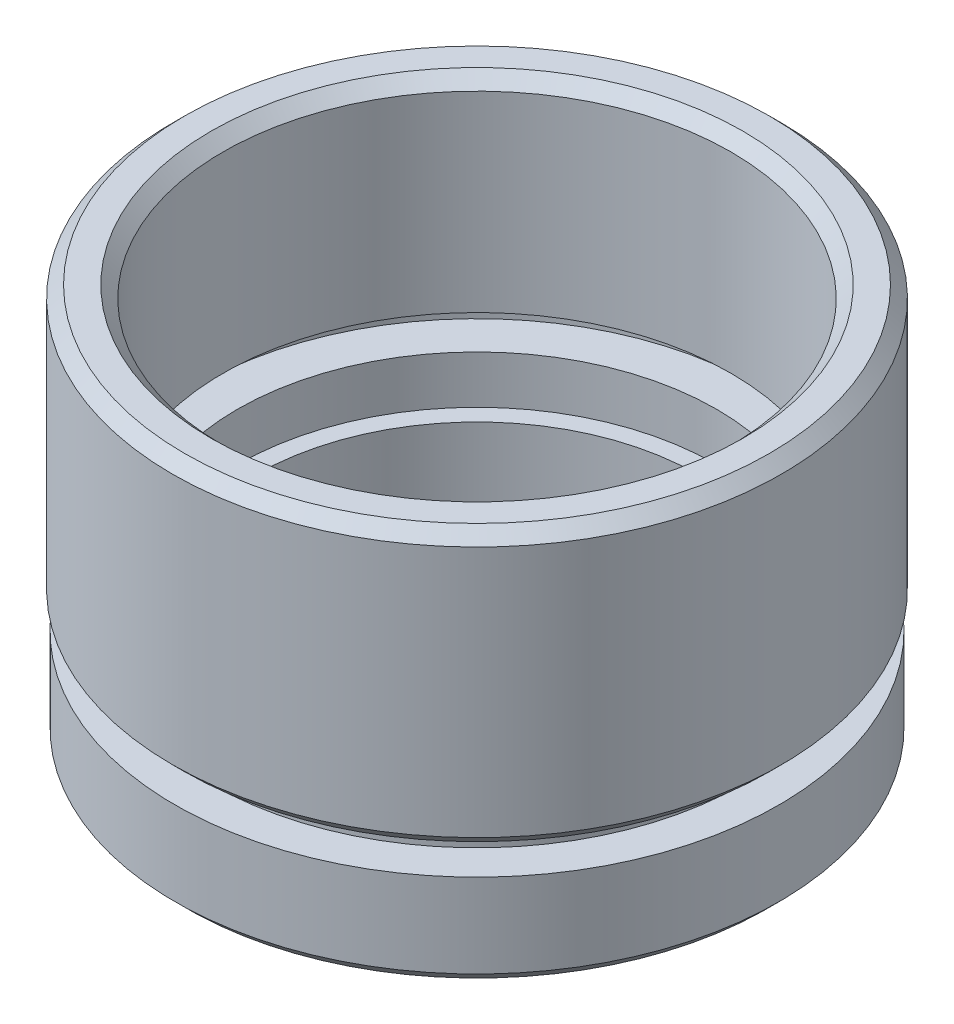
ISO-10303-21;
HEADER;
FILE_DESCRIPTION(('STEP AP214'),'2;1');
FILE_NAME('part.step','',(''),(''),'','','');
FILE_SCHEMA(('AUTOMOTIVE_DESIGN { 1 0 10303 214 1 1 1 1 }'));
ENDSEC;
DATA;
#1=APPLICATION_CONTEXT('core data for automotive mechanical design processes');
#2=APPLICATION_PROTOCOL_DEFINITION('international standard','automotive_design',2000,#1);
#3=PRODUCT_CONTEXT('',#1,'mechanical');
#4=PRODUCT('Part','Part','',(#3));
#5=PRODUCT_RELATED_PRODUCT_CATEGORY('part','',(#4));
#6=PRODUCT_DEFINITION_FORMATION('','',#4);
#7=PRODUCT_DEFINITION_CONTEXT('part definition',#1,'design');
#8=PRODUCT_DEFINITION('design','',#6,#7);
#9=PRODUCT_DEFINITION_SHAPE('','',#8);
#10=(LENGTH_UNIT() NAMED_UNIT(*) SI_UNIT(.MILLI.,.METRE.));
#11=(NAMED_UNIT(*) PLANE_ANGLE_UNIT() SI_UNIT($,.RADIAN.));
#12=(NAMED_UNIT(*) SI_UNIT($,.STERADIAN.) SOLID_ANGLE_UNIT());
#13=UNCERTAINTY_MEASURE_WITH_UNIT(LENGTH_MEASURE(1.E-05),#10,'distance_accuracy_value','');
#14=(GEOMETRIC_REPRESENTATION_CONTEXT(3) GLOBAL_UNCERTAINTY_ASSIGNED_CONTEXT((#13)) GLOBAL_UNIT_ASSIGNED_CONTEXT((#10,
#11,#12)) REPRESENTATION_CONTEXT('',''));
#15=CARTESIAN_POINT('',(0.,0.,0.));
#16=DIRECTION('',(0.,0.,1.));
#17=DIRECTION('',(1.,0.,0.));
#18=AXIS2_PLACEMENT_3D('',#15,#16,#17);
#19=CARTESIAN_POINT('',(0.,0.,0.));
#20=DIRECTION('',(0.,-1.,0.));
#21=DIRECTION('',(0.,0.,-1.));
#22=AXIS2_PLACEMENT_3D('',#19,#20,#21);
#23=CYLINDRICAL_SURFACE('',#22,9.25);
#24=CARTESIAN_POINT('',(0.,0.,0.));
#25=DIRECTION('',(0.,-1.,0.));
#26=DIRECTION('',(0.,0.,-1.));
#27=AXIS2_PLACEMENT_3D('',#24,#25,#26);
#28=CIRCLE('',#27,9.25);
#29=CARTESIAN_POINT('',(0.,0.,-9.25));
#30=VERTEX_POINT('',#29);
#31=EDGE_CURVE('E67',#30,#30,#28,.T.);
#32=ORIENTED_EDGE('',*,*,#31,.T.);
#33=EDGE_LOOP('',(#32));
#34=FACE_BOUND('',#33,.T.);
#35=CARTESIAN_POINT('',(0.,5.,0.));
#36=DIRECTION('',(0.,-1.,0.));
#37=DIRECTION('',(0.,0.,-1.));
#38=AXIS2_PLACEMENT_3D('',#35,#36,#37);
#39=CIRCLE('',#38,9.25);
#40=CARTESIAN_POINT('',(0.,5.,-9.25));
#41=VERTEX_POINT('',#40);
#42=EDGE_CURVE('E94',#41,#41,#39,.T.);
#43=ORIENTED_EDGE('',*,*,#42,.F.);
#44=EDGE_LOOP('',(#43));
#45=FACE_BOUND('',#44,.T.);
#46=ADVANCED_FACE('F35',(#34,#45),#23,.F.);
#47=CARTESIAN_POINT('',(9.25,0.,0.));
#48=DIRECTION('',(0.,-1.,0.));
#49=DIRECTION('',(0.,0.,-1.));
#50=AXIS2_PLACEMENT_3D('',#47,#48,#49);
#51=PLANE('',#50);
#52=CARTESIAN_POINT('',(0.,0.,0.));
#53=DIRECTION('',(0.,-1.,0.));
#54=DIRECTION('',(0.,0.,-1.));
#55=AXIS2_PLACEMENT_3D('',#52,#53,#54);
#56=CIRCLE('',#55,12.1);
#57=CARTESIAN_POINT('',(0.,0.,-12.1));
#58=VERTEX_POINT('',#57);
#59=EDGE_CURVE('E42',#58,#58,#56,.T.);
#60=ORIENTED_EDGE('',*,*,#59,.T.);
#61=EDGE_LOOP('',(#60));
#62=FACE_BOUND('',#61,.T.);
#63=ORIENTED_EDGE('',*,*,#31,.F.);
#64=EDGE_LOOP('',(#63));
#65=FACE_BOUND('',#64,.T.);
#66=ADVANCED_FACE('F102',(#62,#65),#51,.T.);
#67=CARTESIAN_POINT('',(0.,0.,0.));
#68=DIRECTION('',(0.,-1.,0.));
#69=DIRECTION('',(0.,0.,-1.));
#70=AXIS2_PLACEMENT_3D('',#67,#68,#69);
#71=CYLINDRICAL_SURFACE('',#70,12.6);
#72=CARTESIAN_POINT('',(0.,0.499999999999997,0.));
#73=DIRECTION('',(0.,-1.,0.));
#74=DIRECTION('',(0.,0.,-1.));
#75=AXIS2_PLACEMENT_3D('',#72,#73,#74);
#76=CIRCLE('',#75,12.6);
#77=CARTESIAN_POINT('',(0.,0.499999999999997,-12.6));
#78=VERTEX_POINT('',#77);
#79=EDGE_CURVE('E10',#78,#78,#76,.F.);
#80=ORIENTED_EDGE('',*,*,#79,.T.);
#81=EDGE_LOOP('',(#80));
#82=FACE_BOUND('',#81,.T.);
#83=CARTESIAN_POINT('',(0.,4.,0.));
#84=DIRECTION('',(0.,-1.,0.));
#85=DIRECTION('',(0.,0.,-1.));
#86=AXIS2_PLACEMENT_3D('',#83,#84,#85);
#87=CIRCLE('',#86,12.6);
#88=CARTESIAN_POINT('',(0.,4.,-12.6));
#89=VERTEX_POINT('',#88);
#90=EDGE_CURVE('E70',#89,#89,#87,.T.);
#91=ORIENTED_EDGE('',*,*,#90,.T.);
#92=EDGE_LOOP('',(#91));
#93=FACE_BOUND('',#92,.T.);
#94=ADVANCED_FACE('F108',(#82,#93),#71,.T.);
#95=CARTESIAN_POINT('',(12.6,4.,0.));
#96=DIRECTION('',(0.,1.,0.));
#97=DIRECTION('',(0.,0.,1.));
#98=AXIS2_PLACEMENT_3D('',#95,#96,#97);
#99=PLANE('',#98);
#100=CARTESIAN_POINT('',(0.,4.,0.));
#101=DIRECTION('',(0.,-1.,0.));
#102=DIRECTION('',(0.,0.,-1.));
#103=AXIS2_PLACEMENT_3D('',#100,#101,#102);
#104=CIRCLE('',#103,11.1);
#105=CARTESIAN_POINT('',(0.,4.,-11.1));
#106=VERTEX_POINT('',#105);
#107=EDGE_CURVE('E73',#106,#106,#104,.T.);
#108=ORIENTED_EDGE('',*,*,#107,.T.);
#109=EDGE_LOOP('',(#108));
#110=FACE_BOUND('',#109,.T.);
#111=ORIENTED_EDGE('',*,*,#90,.F.);
#112=EDGE_LOOP('',(#111));
#113=FACE_BOUND('',#112,.T.);
#114=ADVANCED_FACE('F140',(#110,#113),#99,.T.);
#115=CARTESIAN_POINT('',(0.,0.,0.));
#116=DIRECTION('',(0.,-1.,0.));
#117=DIRECTION('',(0.,0.,-1.));
#118=AXIS2_PLACEMENT_3D('',#115,#116,#117);
#119=CYLINDRICAL_SURFACE('',#118,11.1);
#120=CARTESIAN_POINT('',(0.,5.,0.));
#121=DIRECTION('',(0.,-1.,0.));
#122=DIRECTION('',(0.,0.,-1.));
#123=AXIS2_PLACEMENT_3D('',#120,#121,#122);
#124=CIRCLE('',#123,11.1);
#125=CARTESIAN_POINT('',(0.,5.,-11.1));
#126=VERTEX_POINT('',#125);
#127=EDGE_CURVE('E76',#126,#126,#124,.T.);
#128=ORIENTED_EDGE('',*,*,#127,.T.);
#129=EDGE_LOOP('',(#128));
#130=FACE_BOUND('',#129,.T.);
#131=ORIENTED_EDGE('',*,*,#107,.F.);
#132=EDGE_LOOP('',(#131));
#133=FACE_BOUND('',#132,.T.);
#134=ADVANCED_FACE('F134',(#130,#133),#119,.T.);
#135=CARTESIAN_POINT('',(11.1,5.,0.));
#136=DIRECTION('',(0.,-1.,0.));
#137=DIRECTION('',(0.,0.,-1.));
#138=AXIS2_PLACEMENT_3D('',#135,#136,#137);
#139=PLANE('',#138);
#140=CARTESIAN_POINT('',(0.,5.,0.));
#141=DIRECTION('',(0.,-1.,0.));
#142=DIRECTION('',(0.,0.,-1.));
#143=AXIS2_PLACEMENT_3D('',#140,#141,#142);
#144=CIRCLE('',#143,12.2);
#145=CARTESIAN_POINT('',(0.,5.,-12.2));
#146=VERTEX_POINT('',#145);
#147=EDGE_CURVE('E46',#146,#146,#144,.T.);
#148=ORIENTED_EDGE('',*,*,#147,.T.);
#149=EDGE_LOOP('',(#148));
#150=FACE_BOUND('',#149,.T.);
#151=ORIENTED_EDGE('',*,*,#127,.F.);
#152=EDGE_LOOP('',(#151));
#153=FACE_BOUND('',#152,.T.);
#154=ADVANCED_FACE('F130',(#150,#153),#139,.T.);
#155=CARTESIAN_POINT('',(0.,0.,0.));
#156=DIRECTION('',(0.,-1.,0.));
#157=DIRECTION('',(0.,0.,-1.));
#158=AXIS2_PLACEMENT_3D('',#155,#156,#157);
#159=CYLINDRICAL_SURFACE('',#158,12.7);
#160=CARTESIAN_POINT('',(0.,16.,0.));
#161=DIRECTION('',(0.,1.,0.));
#162=DIRECTION('',(0.,0.,1.));
#163=AXIS2_PLACEMENT_3D('',#160,#161,#162);
#164=CIRCLE('',#163,12.7);
#165=CARTESIAN_POINT('',(0.,16.,12.7));
#166=VERTEX_POINT('',#165);
#167=EDGE_CURVE('E50',#166,#166,#164,.F.);
#168=ORIENTED_EDGE('',*,*,#167,.T.);
#169=EDGE_LOOP('',(#168));
#170=FACE_BOUND('',#169,.T.);
#171=CARTESIAN_POINT('',(0.,5.49999999999999,0.));
#172=DIRECTION('',(0.,-1.,0.));
#173=DIRECTION('',(0.,0.,-1.));
#174=AXIS2_PLACEMENT_3D('',#171,#172,#173);
#175=CIRCLE('',#174,12.7);
#176=CARTESIAN_POINT('',(0.,5.49999999999999,-12.7));
#177=VERTEX_POINT('',#176);
#178=EDGE_CURVE('E55',#177,#177,#175,.F.);
#179=ORIENTED_EDGE('',*,*,#178,.T.);
#180=EDGE_LOOP('',(#179));
#181=FACE_BOUND('',#180,.T.);
#182=ADVANCED_FACE('F133',(#170,#181),#159,.T.);
#183=CARTESIAN_POINT('',(12.7,16.5,0.));
#184=DIRECTION('',(0.,1.,0.));
#185=DIRECTION('',(0.,0.,1.));
#186=AXIS2_PLACEMENT_3D('',#183,#184,#185);
#187=PLANE('',#186);
#188=CARTESIAN_POINT('',(0.,16.5,0.));
#189=DIRECTION('',(0.,1.,0.));
#190=DIRECTION('',(0.,0.,1.));
#191=AXIS2_PLACEMENT_3D('',#188,#189,#190);
#192=CIRCLE('',#191,11.1);
#193=CARTESIAN_POINT('',(0.,16.5,11.1));
#194=VERTEX_POINT('',#193);
#195=EDGE_CURVE('E61',#194,#194,#192,.F.);
#196=ORIENTED_EDGE('',*,*,#195,.T.);
#197=EDGE_LOOP('',(#196));
#198=FACE_BOUND('',#197,.T.);
#199=CARTESIAN_POINT('',(0.,16.5,0.));
#200=DIRECTION('',(0.,1.,0.));
#201=DIRECTION('',(0.,0.,1.));
#202=AXIS2_PLACEMENT_3D('',#199,#200,#201);
#203=CIRCLE('',#202,12.2);
#204=CARTESIAN_POINT('',(0.,16.5,12.2));
#205=VERTEX_POINT('',#204);
#206=EDGE_CURVE('E64',#205,#205,#203,.T.);
#207=ORIENTED_EDGE('',*,*,#206,.T.);
#208=EDGE_LOOP('',(#207));
#209=FACE_BOUND('',#208,.T.);
#210=ADVANCED_FACE('F155',(#198,#209),#187,.T.);
#211=CARTESIAN_POINT('',(0.,0.,0.));
#212=DIRECTION('',(0.,-1.,0.));
#213=DIRECTION('',(0.,0.,-1.));
#214=AXIS2_PLACEMENT_3D('',#211,#212,#213);
#215=CYLINDRICAL_SURFACE('',#214,10.6);
#216=CARTESIAN_POINT('',(0.,16.,0.));
#217=DIRECTION('',(0.,1.,0.));
#218=DIRECTION('',(0.,0.,1.));
#219=AXIS2_PLACEMENT_3D('',#216,#217,#218);
#220=CIRCLE('',#219,10.6);
#221=CARTESIAN_POINT('',(0.,16.,10.6));
#222=VERTEX_POINT('',#221);
#223=EDGE_CURVE('E58',#222,#222,#220,.T.);
#224=ORIENTED_EDGE('',*,*,#223,.T.);
#225=EDGE_LOOP('',(#224));
#226=FACE_BOUND('',#225,.T.);
#227=CARTESIAN_POINT('',(0.,8.,0.));
#228=DIRECTION('',(0.,-1.,0.));
#229=DIRECTION('',(0.,0.,-1.));
#230=AXIS2_PLACEMENT_3D('',#227,#228,#229);
#231=CIRCLE('',#230,10.6);
#232=CARTESIAN_POINT('',(0.,8.,-10.6));
#233=VERTEX_POINT('',#232);
#234=EDGE_CURVE('E79',#233,#233,#231,.T.);
#235=ORIENTED_EDGE('',*,*,#234,.T.);
#236=EDGE_LOOP('',(#235));
#237=FACE_BOUND('',#236,.T.);
#238=ADVANCED_FACE('F159',(#226,#237),#215,.F.);
#239=CARTESIAN_POINT('',(10.6,8.,0.));
#240=DIRECTION('',(0.,-1.,0.));
#241=DIRECTION('',(0.,0.,-1.));
#242=AXIS2_PLACEMENT_3D('',#239,#240,#241);
#243=PLANE('',#242);
#244=CARTESIAN_POINT('',(0.,8.,0.));
#245=DIRECTION('',(0.,-1.,0.));
#246=DIRECTION('',(0.,0.,-1.));
#247=AXIS2_PLACEMENT_3D('',#244,#245,#246);
#248=CIRCLE('',#247,11.7);
#249=CARTESIAN_POINT('',(0.,8.,-11.7));
#250=VERTEX_POINT('',#249);
#251=EDGE_CURVE('E82',#250,#250,#248,.T.);
#252=ORIENTED_EDGE('',*,*,#251,.T.);
#253=EDGE_LOOP('',(#252));
#254=FACE_BOUND('',#253,.T.);
#255=ORIENTED_EDGE('',*,*,#234,.F.);
#256=EDGE_LOOP('',(#255));
#257=FACE_BOUND('',#256,.T.);
#258=ADVANCED_FACE('F163',(#254,#257),#243,.T.);
#259=CARTESIAN_POINT('',(0.,0.,0.));
#260=DIRECTION('',(0.,-1.,0.));
#261=DIRECTION('',(0.,0.,-1.));
#262=AXIS2_PLACEMENT_3D('',#259,#260,#261);
#263=CYLINDRICAL_SURFACE('',#262,11.7);
#264=CARTESIAN_POINT('',(0.,7.,0.));
#265=DIRECTION('',(0.,-1.,0.));
#266=DIRECTION('',(0.,0.,-1.));
#267=AXIS2_PLACEMENT_3D('',#264,#265,#266);
#268=CIRCLE('',#267,11.7);
#269=CARTESIAN_POINT('',(0.,7.,-11.7));
#270=VERTEX_POINT('',#269);
#271=EDGE_CURVE('E85',#270,#270,#268,.T.);
#272=ORIENTED_EDGE('',*,*,#271,.T.);
#273=EDGE_LOOP('',(#272));
#274=FACE_BOUND('',#273,.T.);
#275=ORIENTED_EDGE('',*,*,#251,.F.);
#276=EDGE_LOOP('',(#275));
#277=FACE_BOUND('',#276,.T.);
#278=ADVANCED_FACE('F167',(#274,#277),#263,.F.);
#279=CARTESIAN_POINT('',(11.7,7.,0.));
#280=DIRECTION('',(0.,1.,0.));
#281=DIRECTION('',(0.,0.,1.));
#282=AXIS2_PLACEMENT_3D('',#279,#280,#281);
#283=PLANE('',#282);
#284=CARTESIAN_POINT('',(0.,7.,0.));
#285=DIRECTION('',(0.,-1.,0.));
#286=DIRECTION('',(0.,0.,-1.));
#287=AXIS2_PLACEMENT_3D('',#284,#285,#286);
#288=CIRCLE('',#287,10.);
#289=CARTESIAN_POINT('',(0.,7.,-10.));
#290=VERTEX_POINT('',#289);
#291=EDGE_CURVE('E88',#290,#290,#288,.T.);
#292=ORIENTED_EDGE('',*,*,#291,.T.);
#293=EDGE_LOOP('',(#292));
#294=FACE_BOUND('',#293,.T.);
#295=ORIENTED_EDGE('',*,*,#271,.F.);
#296=EDGE_LOOP('',(#295));
#297=FACE_BOUND('',#296,.T.);
#298=ADVANCED_FACE('F171',(#294,#297),#283,.T.);
#299=CARTESIAN_POINT('',(0.,0.,0.));
#300=DIRECTION('',(0.,-1.,0.));
#301=DIRECTION('',(0.,0.,-1.));
#302=AXIS2_PLACEMENT_3D('',#299,#300,#301);
#303=CYLINDRICAL_SURFACE('',#302,10.);
#304=CARTESIAN_POINT('',(0.,5.,0.));
#305=DIRECTION('',(0.,-1.,0.));
#306=DIRECTION('',(0.,0.,-1.));
#307=AXIS2_PLACEMENT_3D('',#304,#305,#306);
#308=CIRCLE('',#307,10.);
#309=CARTESIAN_POINT('',(0.,5.,-10.));
#310=VERTEX_POINT('',#309);
#311=EDGE_CURVE('E91',#310,#310,#308,.T.);
#312=ORIENTED_EDGE('',*,*,#311,.T.);
#313=EDGE_LOOP('',(#312));
#314=FACE_BOUND('',#313,.T.);
#315=ORIENTED_EDGE('',*,*,#291,.F.);
#316=EDGE_LOOP('',(#315));
#317=FACE_BOUND('',#316,.T.);
#318=ADVANCED_FACE('F175',(#314,#317),#303,.F.);
#319=CARTESIAN_POINT('',(10.,5.,0.));
#320=DIRECTION('',(0.,1.,0.));
#321=DIRECTION('',(0.,0.,1.));
#322=AXIS2_PLACEMENT_3D('',#319,#320,#321);
#323=PLANE('',#322);
#324=ORIENTED_EDGE('',*,*,#42,.T.);
#325=EDGE_LOOP('',(#324));
#326=FACE_BOUND('',#325,.T.);
#327=ORIENTED_EDGE('',*,*,#311,.F.);
#328=EDGE_LOOP('',(#327));
#329=FACE_BOUND('',#328,.T.);
#330=ADVANCED_FACE('F98',(#326,#329),#323,.T.);
#331=CARTESIAN_POINT('',(0.,16.5,0.));
#332=DIRECTION('',(0.,1.,0.));
#333=DIRECTION('',(0.,0.,1.));
#334=AXIS2_PLACEMENT_3D('',#331,#332,#333);
#335=CONICAL_SURFACE('',#334,11.1,0.785398163397452);
#336=ORIENTED_EDGE('',*,*,#223,.F.);
#337=EDGE_LOOP('',(#336));
#338=FACE_BOUND('',#337,.T.);
#339=ORIENTED_EDGE('',*,*,#195,.F.);
#340=EDGE_LOOP('',(#339));
#341=FACE_BOUND('',#340,.T.);
#342=ADVANCED_FACE('F112',(#338,#341),#335,.F.);
#343=CARTESIAN_POINT('',(0.,16.,0.));
#344=DIRECTION('',(0.,-1.,0.));
#345=DIRECTION('',(0.,0.,-1.));
#346=AXIS2_PLACEMENT_3D('',#343,#344,#345);
#347=CONICAL_SURFACE('',#346,12.7,0.78539816339745);
#348=ORIENTED_EDGE('',*,*,#206,.F.);
#349=EDGE_LOOP('',(#348));
#350=FACE_BOUND('',#349,.T.);
#351=ORIENTED_EDGE('',*,*,#167,.F.);
#352=EDGE_LOOP('',(#351));
#353=FACE_BOUND('',#352,.T.);
#354=ADVANCED_FACE('F115',(#350,#353),#347,.T.);
#355=CARTESIAN_POINT('',(0.,5.,0.));
#356=DIRECTION('',(0.,1.,0.));
#357=DIRECTION('',(0.,0.,1.));
#358=AXIS2_PLACEMENT_3D('',#355,#356,#357);
#359=CONICAL_SURFACE('',#358,12.2,0.785398163397443);
#360=ORIENTED_EDGE('',*,*,#178,.F.);
#361=EDGE_LOOP('',(#360));
#362=FACE_BOUND('',#361,.T.);
#363=ORIENTED_EDGE('',*,*,#147,.F.);
#364=EDGE_LOOP('',(#363));
#365=FACE_BOUND('',#364,.T.);
#366=ADVANCED_FACE('F118',(#362,#365),#359,.T.);
#367=CARTESIAN_POINT('',(0.,0.,0.));
#368=DIRECTION('',(0.,1.,0.));
#369=DIRECTION('',(0.,0.,1.));
#370=AXIS2_PLACEMENT_3D('',#367,#368,#369);
#371=CONICAL_SURFACE('',#370,12.1,0.785398163397447);
#372=ORIENTED_EDGE('',*,*,#79,.F.);
#373=EDGE_LOOP('',(#372));
#374=FACE_BOUND('',#373,.T.);
#375=ORIENTED_EDGE('',*,*,#59,.F.);
#376=EDGE_LOOP('',(#375));
#377=FACE_BOUND('',#376,.T.);
#378=ADVANCED_FACE('F37',(#374,#377),#371,.T.);
#379=CLOSED_SHELL('',(#46,#66,#94,#114,#134,#154,#182,#210,#238,#258,#278,#298,#318,#330,#342,
#354,#366,#378));
#380=MANIFOLD_SOLID_BREP('B2',#379);
#381=ADVANCED_BREP_SHAPE_REPRESENTATION('',(#18,#380),#14);
#382=SHAPE_DEFINITION_REPRESENTATION(#9,#381);
ENDSEC;
END-ISO-10303-21;
